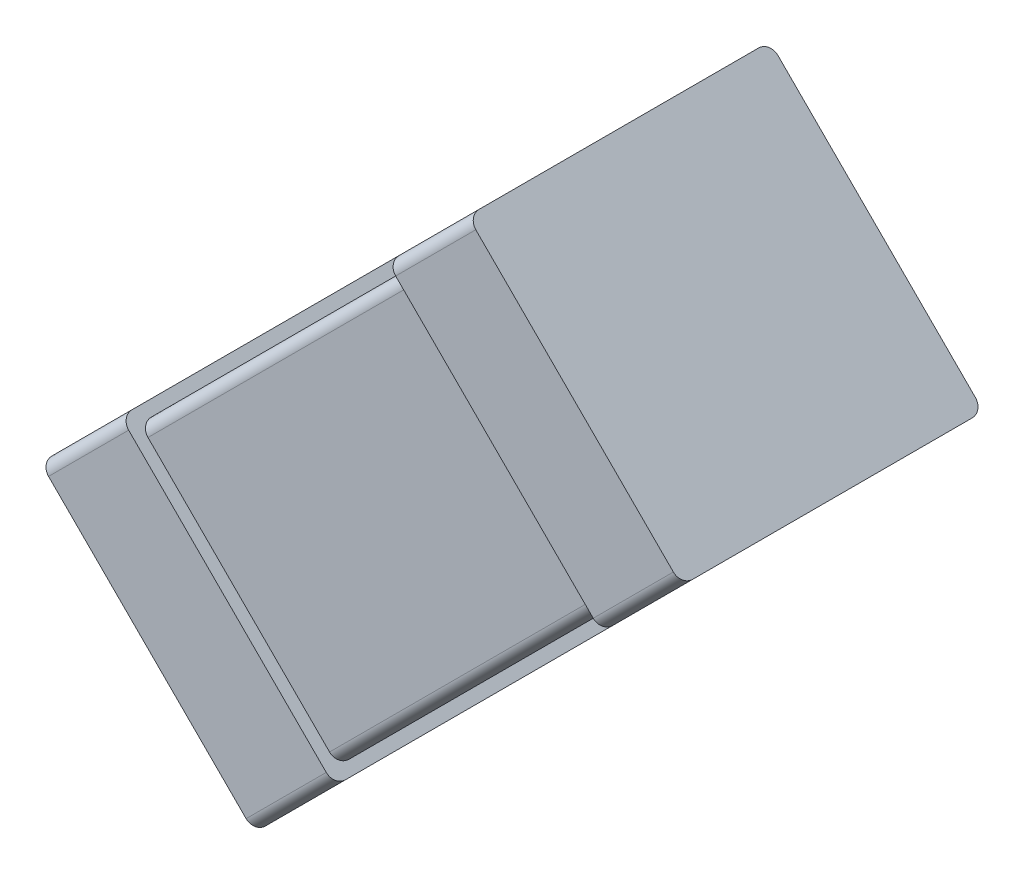
ISO-10303-21;
HEADER;
FILE_DESCRIPTION(('STEP AP214'),'2;1');
FILE_NAME('part.step','',(''),(''),'','','');
FILE_SCHEMA(('AUTOMOTIVE_DESIGN { 1 0 10303 214 1 1 1 1 }'));
ENDSEC;
DATA;
#1=APPLICATION_CONTEXT('core data for automotive mechanical design processes');
#2=APPLICATION_PROTOCOL_DEFINITION('international standard','automotive_design',2000,#1);
#3=PRODUCT_CONTEXT('',#1,'mechanical');
#4=PRODUCT('Part','Part','',(#3));
#5=PRODUCT_RELATED_PRODUCT_CATEGORY('part','',(#4));
#6=PRODUCT_DEFINITION_FORMATION('','',#4);
#7=PRODUCT_DEFINITION_CONTEXT('part definition',#1,'design');
#8=PRODUCT_DEFINITION('design','',#6,#7);
#9=PRODUCT_DEFINITION_SHAPE('','',#8);
#10=(LENGTH_UNIT() NAMED_UNIT(*) SI_UNIT(.MILLI.,.METRE.));
#11=(NAMED_UNIT(*) PLANE_ANGLE_UNIT() SI_UNIT($,.RADIAN.));
#12=(NAMED_UNIT(*) SI_UNIT($,.STERADIAN.) SOLID_ANGLE_UNIT());
#13=UNCERTAINTY_MEASURE_WITH_UNIT(LENGTH_MEASURE(1.E-05),#10,'distance_accuracy_value','');
#14=(GEOMETRIC_REPRESENTATION_CONTEXT(3) GLOBAL_UNCERTAINTY_ASSIGNED_CONTEXT((#13)) GLOBAL_UNIT_ASSIGNED_CONTEXT((#10,
#11,#12)) REPRESENTATION_CONTEXT('',''));
#15=CARTESIAN_POINT('',(0.,0.,0.));
#16=DIRECTION('',(0.,0.,1.));
#17=DIRECTION('',(1.,0.,0.));
#18=AXIS2_PLACEMENT_3D('',#15,#16,#17);
#19=CARTESIAN_POINT('',(168.761272417362,108.552886004825,112.211582908599));
#20=DIRECTION('',(0.707106781186547,0.707106781186548,0.));
#21=DIRECTION('',(0.,0.,-1.));
#22=AXIS2_PLACEMENT_3D('',#19,#20,#21);
#23=PLANE('',#22);
#24=DIRECTION('',(0.,0.,1.));
#25=VECTOR('',#24,1.);
#26=CARTESIAN_POINT('',(168.761272417362,108.552886004825,112.211582908599));
#27=LINE('',#26,#25);
#28=CARTESIAN_POINT('',(168.761272417362,108.552886004825,112.241582908599));
#29=VERTEX_POINT('',#28);
#30=CARTESIAN_POINT('',(168.761272417362,108.552886004825,112.981582908599));
#31=VERTEX_POINT('',#30);
#32=EDGE_CURVE('E67',#29,#31,#27,.T.);
#33=ORIENTED_EDGE('',*,*,#32,.F.);
#34=CARTESIAN_POINT('',(168.740059213926,108.57409920826,112.241582908599));
#35=DIRECTION('',(0.707106781186547,0.707106781186548,0.));
#36=DIRECTION('',(0.,0.,1.));
#37=AXIS2_PLACEMENT_3D('',#34,#35,#36);
#38=CIRCLE('',#37,0.0300000000000023);
#39=CARTESIAN_POINT('',(168.740059213926,108.57409920826,112.211582908599));
#40=VERTEX_POINT('',#39);
#41=EDGE_CURVE('E11',#29,#40,#38,.T.);
#42=ORIENTED_EDGE('',*,*,#41,.T.);
#43=DIRECTION('',(-0.707106781186548,0.707106781186547,0.));
#44=VECTOR('',#43,1.);
#45=CARTESIAN_POINT('',(168.761272417362,108.552886004825,112.211582908599));
#46=LINE('',#45,#44);
#47=CARTESIAN_POINT('',(168.216800195848,109.097358226338,112.211582908599));
#48=VERTEX_POINT('',#47);
#49=EDGE_CURVE('E55',#40,#48,#46,.T.);
#50=ORIENTED_EDGE('',*,*,#49,.T.);
#51=CARTESIAN_POINT('',(168.216800195848,109.097358226338,112.241582908599));
#52=DIRECTION('',(-0.707106781186547,-0.707106781186548,0.));
#53=DIRECTION('',(0.,0.,1.));
#54=AXIS2_PLACEMENT_3D('',#51,#52,#53);
#55=CIRCLE('',#54,0.0300000000000023);
#56=CARTESIAN_POINT('',(168.195586992413,109.118571429774,112.241582908599));
#57=VERTEX_POINT('',#56);
#58=EDGE_CURVE('E287',#57,#48,#55,.T.);
#59=ORIENTED_EDGE('',*,*,#58,.F.);
#60=DIRECTION('',(0.,0.,1.));
#61=VECTOR('',#60,1.);
#62=CARTESIAN_POINT('',(168.195586992413,109.118571429774,112.211582908599));
#63=LINE('',#62,#61);
#64=CARTESIAN_POINT('',(168.195586992413,109.118571429774,112.981582908599));
#65=VERTEX_POINT('',#64);
#66=EDGE_CURVE('E277',#57,#65,#63,.T.);
#67=ORIENTED_EDGE('',*,*,#66,.T.);
#68=CARTESIAN_POINT('',(168.216800195848,109.097358226338,112.981582908599));
#69=DIRECTION('',(0.707106781186547,0.707106781186548,0.));
#70=DIRECTION('',(0.,0.,1.));
#71=AXIS2_PLACEMENT_3D('',#68,#69,#70);
#72=CIRCLE('',#71,0.0300000000000023);
#73=CARTESIAN_POINT('',(168.216800195848,109.097358226338,113.011582908599));
#74=VERTEX_POINT('',#73);
#75=EDGE_CURVE('E281',#65,#74,#72,.T.);
#76=ORIENTED_EDGE('',*,*,#75,.T.);
#77=DIRECTION('',(-0.707106781186548,0.707106781186547,0.));
#78=VECTOR('',#77,1.);
#79=CARTESIAN_POINT('',(168.761272417362,108.552886004825,113.011582908599));
#80=LINE('',#79,#78);
#81=CARTESIAN_POINT('',(168.740059213926,108.57409920826,113.011582908599));
#82=VERTEX_POINT('',#81);
#83=EDGE_CURVE('E264',#82,#74,#80,.T.);
#84=ORIENTED_EDGE('',*,*,#83,.F.);
#85=CARTESIAN_POINT('',(168.740059213926,108.57409920826,112.981582908599));
#86=DIRECTION('',(-0.707106781186547,-0.707106781186548,0.));
#87=DIRECTION('',(0.,0.,1.));
#88=AXIS2_PLACEMENT_3D('',#85,#86,#87);
#89=CIRCLE('',#88,0.0300000000000023);
#90=EDGE_CURVE('E418',#31,#82,#89,.T.);
#91=ORIENTED_EDGE('',*,*,#90,.F.);
#92=EDGE_LOOP('',(#33,#42,#50,#59,#67,#76,#84,#91));
#93=FACE_BOUND('',#92,.T.);
#94=ADVANCED_FACE('F44',(#93),#23,.T.);
#95=CARTESIAN_POINT('',(167.983454958057,108.906439395418,112.211582908599));
#96=DIRECTION('',(-0.707106781186548,0.707106781186547,0.));
#97=DIRECTION('',(0.,0.,1.));
#98=AXIS2_PLACEMENT_3D('',#95,#96,#97);
#99=PLANE('',#98);
#100=ORIENTED_EDGE('',*,*,#66,.F.);
#101=DIRECTION('',(0.707106781186547,0.707106781186548,0.));
#102=VECTOR('',#101,1.);
#103=CARTESIAN_POINT('',(167.983454958057,108.906439395418,112.241582908599));
#104=LINE('',#103,#102);
#105=CARTESIAN_POINT('',(167.983454958057,108.906439395418,112.241582908599));
#106=VERTEX_POINT('',#105);
#107=EDGE_CURVE('E282',#106,#57,#104,.T.);
#108=ORIENTED_EDGE('',*,*,#107,.F.);
#109=DIRECTION('',(0.,0.,1.));
#110=VECTOR('',#109,1.);
#111=CARTESIAN_POINT('',(167.983454958057,108.906439395418,112.211582908599));
#112=LINE('',#111,#110);
#113=CARTESIAN_POINT('',(167.983454958057,108.906439395418,112.981582908599));
#114=VERTEX_POINT('',#113);
#115=EDGE_CURVE('E392',#106,#114,#112,.T.);
#116=ORIENTED_EDGE('',*,*,#115,.T.);
#117=DIRECTION('',(0.707106781186547,0.707106781186548,0.));
#118=VECTOR('',#117,1.);
#119=CARTESIAN_POINT('',(167.983454958057,108.906439395418,112.981582908599));
#120=LINE('',#119,#118);
#121=EDGE_CURVE('E384',#114,#65,#120,.T.);
#122=ORIENTED_EDGE('',*,*,#121,.T.);
#123=EDGE_LOOP('',(#100,#108,#116,#122));
#124=FACE_BOUND('',#123,.T.);
#125=ADVANCED_FACE('F591',(#124),#99,.T.);
#126=CARTESIAN_POINT('',(168.004668161492,108.885226191982,112.981582908599));
#127=DIRECTION('',(0.707106781186548,0.707106781186548,0.));
#128=DIRECTION('',(-0.707106781186548,0.707106781186548,0.));
#129=AXIS2_PLACEMENT_3D('',#126,#127,#128);
#130=CYLINDRICAL_SURFACE('',#129,0.0299999999999963);
#131=CARTESIAN_POINT('',(168.004668161492,108.885226191982,112.981582908599));
#132=DIRECTION('',(0.707106781186547,0.707106781186548,0.));
#133=DIRECTION('',(0.,0.,1.));
#134=AXIS2_PLACEMENT_3D('',#131,#132,#133);
#135=CIRCLE('',#134,0.0300000000000023);
#136=CARTESIAN_POINT('',(168.004668161492,108.885226191982,113.011582908599));
#137=VERTEX_POINT('',#136);
#138=EDGE_CURVE('E377',#114,#137,#135,.T.);
#139=ORIENTED_EDGE('',*,*,#138,.T.);
#140=DIRECTION('',(0.707106781186547,0.707106781186548,0.));
#141=VECTOR('',#140,1.);
#142=CARTESIAN_POINT('',(168.004668161492,108.885226191982,113.011582908599));
#143=LINE('',#142,#141);
#144=EDGE_CURVE('E286',#137,#74,#143,.T.);
#145=ORIENTED_EDGE('',*,*,#144,.T.);
#146=ORIENTED_EDGE('',*,*,#75,.F.);
#147=ORIENTED_EDGE('',*,*,#121,.F.);
#148=EDGE_LOOP('',(#139,#145,#146,#147));
#149=FACE_BOUND('',#148,.T.);
#150=ADVANCED_FACE('F596',(#149),#130,.T.);
#151=CARTESIAN_POINT('',(168.004668161492,108.885226191982,112.241582908599));
#152=DIRECTION('',(0.707106781186548,0.707106781186548,0.));
#153=DIRECTION('',(-0.707106781186548,0.707106781186548,0.));
#154=AXIS2_PLACEMENT_3D('',#151,#152,#153);
#155=CYLINDRICAL_SURFACE('',#154,0.0299999999999963);
#156=ORIENTED_EDGE('',*,*,#107,.T.);
#157=ORIENTED_EDGE('',*,*,#58,.T.);
#158=DIRECTION('',(0.707106781186547,0.707106781186548,0.));
#159=VECTOR('',#158,1.);
#160=CARTESIAN_POINT('',(168.004668161492,108.885226191982,112.211582908599));
#161=LINE('',#160,#159);
#162=CARTESIAN_POINT('',(168.004668161492,108.885226191982,112.211582908599));
#163=VERTEX_POINT('',#162);
#164=EDGE_CURVE('E396',#163,#48,#161,.T.);
#165=ORIENTED_EDGE('',*,*,#164,.F.);
#166=CARTESIAN_POINT('',(168.004668161492,108.885226191982,112.241582908599));
#167=DIRECTION('',(-0.707106781186547,-0.707106781186548,0.));
#168=DIRECTION('',(0.,0.,1.));
#169=AXIS2_PLACEMENT_3D('',#166,#167,#168);
#170=CIRCLE('',#169,0.0300000000000023);
#171=EDGE_CURVE('E305',#106,#163,#170,.T.);
#172=ORIENTED_EDGE('',*,*,#171,.F.);
#173=EDGE_LOOP('',(#156,#157,#165,#172));
#174=FACE_BOUND('',#173,.T.);
#175=ADVANCED_FACE('F648',(#174),#155,.T.);
#176=CARTESIAN_POINT('',(168.549140383006,108.340753970469,113.011582908599));
#177=DIRECTION('',(0.,0.,1.));
#178=DIRECTION('',(1.,0.,0.));
#179=AXIS2_PLACEMENT_3D('',#176,#177,#178);
#180=PLANE('',#179);
#181=DIRECTION('',(-0.707106781186548,0.707106781186547,0.));
#182=VECTOR('',#181,1.);
#183=CARTESIAN_POINT('',(168.549140383006,108.340753970469,113.011582908599));
#184=LINE('',#183,#182);
#185=CARTESIAN_POINT('',(168.52792717957,108.361967173904,113.011582908599));
#186=VERTEX_POINT('',#185);
#187=EDGE_CURVE('E308',#186,#137,#184,.T.);
#188=ORIENTED_EDGE('',*,*,#187,.F.);
#189=DIRECTION('',(0.707106781186547,0.707106781186548,0.));
#190=VECTOR('',#189,1.);
#191=CARTESIAN_POINT('',(168.52792717957,108.361967173904,113.011582908599));
#192=LINE('',#191,#190);
#193=EDGE_CURVE('E452',#186,#82,#192,.T.);
#194=ORIENTED_EDGE('',*,*,#193,.T.);
#195=ORIENTED_EDGE('',*,*,#83,.T.);
#196=ORIENTED_EDGE('',*,*,#144,.F.);
#197=EDGE_LOOP('',(#188,#194,#195,#196));
#198=FACE_BOUND('',#197,.T.);
#199=ADVANCED_FACE('F46',(#198),#180,.T.);
#200=CARTESIAN_POINT('',(168.549140383006,108.340753970469,112.211582908599));
#201=DIRECTION('',(0.,0.,1.));
#202=DIRECTION('',(1.,0.,0.));
#203=AXIS2_PLACEMENT_3D('',#200,#201,#202);
#204=PLANE('',#203);
#205=ORIENTED_EDGE('',*,*,#164,.T.);
#206=ORIENTED_EDGE('',*,*,#49,.F.);
#207=DIRECTION('',(0.707106781186547,0.707106781186548,0.));
#208=VECTOR('',#207,1.);
#209=CARTESIAN_POINT('',(168.52792717957,108.361967173904,112.211582908599));
#210=LINE('',#209,#208);
#211=CARTESIAN_POINT('',(168.52792717957,108.361967173904,112.211582908599));
#212=VERTEX_POINT('',#211);
#213=EDGE_CURVE('E329',#212,#40,#210,.T.);
#214=ORIENTED_EDGE('',*,*,#213,.F.);
#215=DIRECTION('',(-0.707106781186548,0.707106781186547,0.));
#216=VECTOR('',#215,1.);
#217=CARTESIAN_POINT('',(168.549140383006,108.340753970469,112.211582908599));
#218=LINE('',#217,#216);
#219=EDGE_CURVE('E399',#212,#163,#218,.T.);
#220=ORIENTED_EDGE('',*,*,#219,.T.);
#221=EDGE_LOOP('',(#205,#206,#214,#220));
#222=FACE_BOUND('',#221,.T.);
#223=ADVANCED_FACE('F647',(#222),#204,.F.);
#224=CARTESIAN_POINT('',(168.52792717957,108.361967173904,112.981582908599));
#225=DIRECTION('',(0.707106781186548,0.707106781186548,0.));
#226=DIRECTION('',(0.707106781186548,-0.707106781186548,0.));
#227=AXIS2_PLACEMENT_3D('',#224,#225,#226);
#228=CYLINDRICAL_SURFACE('',#227,0.0299999999999963);
#229=DIRECTION('',(0.707106781186547,0.707106781186548,0.));
#230=VECTOR('',#229,1.);
#231=CARTESIAN_POINT('',(168.549140383006,108.340753970469,112.981582908599));
#232=LINE('',#231,#230);
#233=CARTESIAN_POINT('',(168.549140383006,108.340753970469,112.981582908599));
#234=VERTEX_POINT('',#233);
#235=EDGE_CURVE('E406',#234,#31,#232,.T.);
#236=ORIENTED_EDGE('',*,*,#235,.T.);
#237=ORIENTED_EDGE('',*,*,#90,.T.);
#238=ORIENTED_EDGE('',*,*,#193,.F.);
#239=CARTESIAN_POINT('',(168.52792717957,108.361967173904,112.981582908599));
#240=DIRECTION('',(-0.707106781186547,-0.707106781186548,0.));
#241=DIRECTION('',(0.,0.,1.));
#242=AXIS2_PLACEMENT_3D('',#239,#240,#241);
#243=CIRCLE('',#242,0.0300000000000023);
#244=EDGE_CURVE('E355',#234,#186,#243,.T.);
#245=ORIENTED_EDGE('',*,*,#244,.F.);
#246=EDGE_LOOP('',(#236,#237,#238,#245));
#247=FACE_BOUND('',#246,.T.);
#248=ADVANCED_FACE('F550',(#247),#228,.T.);
#249=CARTESIAN_POINT('',(168.52792717957,108.361967173904,112.241582908599));
#250=DIRECTION('',(0.707106781186548,0.707106781186548,0.));
#251=DIRECTION('',(0.707106781186548,-0.707106781186548,0.));
#252=AXIS2_PLACEMENT_3D('',#249,#250,#251);
#253=CYLINDRICAL_SURFACE('',#252,0.0299999999999963);
#254=CARTESIAN_POINT('',(168.52792717957,108.361967173904,112.241582908599));
#255=DIRECTION('',(0.707106781186547,0.707106781186548,0.));
#256=DIRECTION('',(0.,0.,1.));
#257=AXIS2_PLACEMENT_3D('',#254,#255,#256);
#258=CIRCLE('',#257,0.0300000000000023);
#259=CARTESIAN_POINT('',(168.549140383006,108.340753970469,112.241582908599));
#260=VERTEX_POINT('',#259);
#261=EDGE_CURVE('E333',#260,#212,#258,.T.);
#262=ORIENTED_EDGE('',*,*,#261,.T.);
#263=ORIENTED_EDGE('',*,*,#213,.T.);
#264=ORIENTED_EDGE('',*,*,#41,.F.);
#265=DIRECTION('',(0.707106781186547,0.707106781186548,0.));
#266=VECTOR('',#265,1.);
#267=CARTESIAN_POINT('',(168.549140383006,108.340753970469,112.241582908599));
#268=LINE('',#267,#266);
#269=EDGE_CURVE('E48',#260,#29,#268,.T.);
#270=ORIENTED_EDGE('',*,*,#269,.F.);
#271=EDGE_LOOP('',(#262,#263,#264,#270));
#272=FACE_BOUND('',#271,.T.);
#273=ADVANCED_FACE('F611',(#272),#253,.T.);
#274=CARTESIAN_POINT('',(168.549140383006,108.340753970469,112.211582908599));
#275=DIRECTION('',(-0.707106781186548,0.707106781186547,0.));
#276=DIRECTION('',(0.,0.,1.));
#277=AXIS2_PLACEMENT_3D('',#274,#275,#276);
#278=PLANE('',#277);
#279=ORIENTED_EDGE('',*,*,#235,.F.);
#280=DIRECTION('',(0.,0.,1.));
#281=VECTOR('',#280,1.);
#282=CARTESIAN_POINT('',(168.549140383006,108.340753970469,112.211582908599));
#283=LINE('',#282,#281);
#284=EDGE_CURVE('E309',#260,#234,#283,.T.);
#285=ORIENTED_EDGE('',*,*,#284,.F.);
#286=ORIENTED_EDGE('',*,*,#269,.T.);
#287=ORIENTED_EDGE('',*,*,#32,.T.);
#288=EDGE_LOOP('',(#279,#285,#286,#287));
#289=FACE_BOUND('',#288,.T.);
#290=ADVANCED_FACE('F560',(#289),#278,.F.);
#291=CARTESIAN_POINT('',(168.549140383006,108.340753970469,112.211582908599));
#292=DIRECTION('',(0.707106781186547,0.707106781186548,0.));
#293=DIRECTION('',(0.,0.,-1.));
#294=AXIS2_PLACEMENT_3D('',#291,#292,#293);
#295=PLANE('',#294);
#296=ORIENTED_EDGE('',*,*,#244,.T.);
#297=ORIENTED_EDGE('',*,*,#187,.T.);
#298=ORIENTED_EDGE('',*,*,#138,.F.);
#299=ORIENTED_EDGE('',*,*,#115,.F.);
#300=ORIENTED_EDGE('',*,*,#171,.T.);
#301=ORIENTED_EDGE('',*,*,#219,.F.);
#302=ORIENTED_EDGE('',*,*,#261,.F.);
#303=ORIENTED_EDGE('',*,*,#284,.T.);
#304=EDGE_LOOP('',(#296,#297,#298,#299,#300,#301,#302,#303));
#305=FACE_BOUND('',#304,.T.);
#306=DIRECTION('',(-0.707106781186548,0.707106781186547,0.));
#307=VECTOR('',#306,1.);
#308=CARTESIAN_POINT('',(168.52792717957,108.361967173904,112.241582908599));
#309=LINE('',#308,#307);
#310=CARTESIAN_POINT('',(168.506713976134,108.38318037734,112.241582908599));
#311=VERTEX_POINT('',#310);
#312=CARTESIAN_POINT('',(168.025881364928,108.864012988547,112.241582908599));
#313=VERTEX_POINT('',#312);
#314=EDGE_CURVE('E341',#311,#313,#309,.T.);
#315=ORIENTED_EDGE('',*,*,#314,.T.);
#316=CARTESIAN_POINT('',(168.025881364928,108.864012988547,112.271582908599));
#317=DIRECTION('',(-0.707106781186547,-0.707106781186548,0.));
#318=DIRECTION('',(0.,0.,1.));
#319=AXIS2_PLACEMENT_3D('',#316,#317,#318);
#320=CIRCLE('',#319,0.0300000000000023);
#321=CARTESIAN_POINT('',(168.004668161492,108.885226191982,112.271582908599));
#322=VERTEX_POINT('',#321);
#323=EDGE_CURVE('E360',#322,#313,#320,.T.);
#324=ORIENTED_EDGE('',*,*,#323,.F.);
#325=DIRECTION('',(0.,0.,1.));
#326=VECTOR('',#325,1.);
#327=CARTESIAN_POINT('',(168.004668161492,108.885226191982,112.241582908599));
#328=LINE('',#327,#326);
#329=CARTESIAN_POINT('',(168.004668161492,108.885226191982,112.951582908599));
#330=VERTEX_POINT('',#329);
#331=EDGE_CURVE('E453',#322,#330,#328,.T.);
#332=ORIENTED_EDGE('',*,*,#331,.T.);
#333=CARTESIAN_POINT('',(168.025881364928,108.864012988547,112.951582908599));
#334=DIRECTION('',(0.707106781186547,0.707106781186548,0.));
#335=DIRECTION('',(0.,0.,1.));
#336=AXIS2_PLACEMENT_3D('',#333,#334,#335);
#337=CIRCLE('',#336,0.0300000000000023);
#338=CARTESIAN_POINT('',(168.025881364928,108.864012988547,112.981582908599));
#339=VERTEX_POINT('',#338);
#340=EDGE_CURVE('E233',#330,#339,#337,.T.);
#341=ORIENTED_EDGE('',*,*,#340,.T.);
#342=DIRECTION('',(-0.707106781186548,0.707106781186547,0.));
#343=VECTOR('',#342,1.);
#344=CARTESIAN_POINT('',(168.52792717957,108.361967173904,112.981582908599));
#345=LINE('',#344,#343);
#346=CARTESIAN_POINT('',(168.506713976134,108.38318037734,112.981582908599));
#347=VERTEX_POINT('',#346);
#348=EDGE_CURVE('E250',#347,#339,#345,.T.);
#349=ORIENTED_EDGE('',*,*,#348,.F.);
#350=CARTESIAN_POINT('',(168.506713976134,108.38318037734,112.951582908599));
#351=DIRECTION('',(-0.707106781186547,-0.707106781186548,0.));
#352=DIRECTION('',(0.,0.,1.));
#353=AXIS2_PLACEMENT_3D('',#350,#351,#352);
#354=CIRCLE('',#353,0.0300000000000023);
#355=CARTESIAN_POINT('',(168.52792717957,108.361967173904,112.951582908599));
#356=VERTEX_POINT('',#355);
#357=EDGE_CURVE('E276',#356,#347,#354,.T.);
#358=ORIENTED_EDGE('',*,*,#357,.F.);
#359=DIRECTION('',(0.,0.,1.));
#360=VECTOR('',#359,1.);
#361=CARTESIAN_POINT('',(168.52792717957,108.361967173904,112.241582908599));
#362=LINE('',#361,#360);
#363=CARTESIAN_POINT('',(168.52792717957,108.361967173904,112.271582908599));
#364=VERTEX_POINT('',#363);
#365=EDGE_CURVE('E275',#364,#356,#362,.T.);
#366=ORIENTED_EDGE('',*,*,#365,.F.);
#367=CARTESIAN_POINT('',(168.506713976134,108.38318037734,112.271582908599));
#368=DIRECTION('',(0.707106781186547,0.707106781186548,0.));
#369=DIRECTION('',(0.,0.,1.));
#370=AXIS2_PLACEMENT_3D('',#367,#368,#369);
#371=CIRCLE('',#370,0.0300000000000023);
#372=EDGE_CURVE('E337',#364,#311,#371,.T.);
#373=ORIENTED_EDGE('',*,*,#372,.T.);
#374=EDGE_LOOP('',(#315,#324,#332,#341,#349,#358,#366,#373));
#375=FACE_BOUND('',#374,.T.);
#376=ADVANCED_FACE('F553',(#305,#375),#295,.F.);
#377=CARTESIAN_POINT('',(167.820820398384,107.654860392718,112.241582908599));
#378=DIRECTION('',(-0.707106781186548,0.707106781186547,0.));
#379=DIRECTION('',(0.,0.,1.));
#380=AXIS2_PLACEMENT_3D('',#377,#378,#379);
#381=PLANE('',#380);
#382=DIRECTION('',(0.707106781186547,0.707106781186548,0.));
#383=VECTOR('',#382,1.);
#384=CARTESIAN_POINT('',(167.820820398384,107.654860392718,112.951582908599));
#385=LINE('',#384,#383);
#386=CARTESIAN_POINT('',(167.820820398384,107.654860392718,112.951582908599));
#387=VERTEX_POINT('',#386);
#388=EDGE_CURVE('E271',#387,#356,#385,.T.);
#389=ORIENTED_EDGE('',*,*,#388,.F.);
#390=DIRECTION('',(0.,0.,1.));
#391=VECTOR('',#390,1.);
#392=CARTESIAN_POINT('',(167.820820398384,107.654860392718,112.241582908599));
#393=LINE('',#392,#391);
#394=CARTESIAN_POINT('',(167.820820398384,107.654860392718,112.271582908599));
#395=VERTEX_POINT('',#394);
#396=EDGE_CURVE('E123',#395,#387,#393,.T.);
#397=ORIENTED_EDGE('',*,*,#396,.F.);
#398=DIRECTION('',(0.707106781186547,0.707106781186548,0.));
#399=VECTOR('',#398,1.);
#400=CARTESIAN_POINT('',(167.820820398384,107.654860392718,112.271582908599));
#401=LINE('',#400,#399);
#402=EDGE_CURVE('E334',#395,#364,#401,.T.);
#403=ORIENTED_EDGE('',*,*,#402,.T.);
#404=ORIENTED_EDGE('',*,*,#365,.T.);
#405=EDGE_LOOP('',(#389,#397,#403,#404));
#406=FACE_BOUND('',#405,.T.);
#407=ADVANCED_FACE('F577',(#406),#381,.F.);
#408=CARTESIAN_POINT('',(167.799607194948,107.676073596153,112.951582908599));
#409=DIRECTION('',(0.707106781186548,0.707106781186548,0.));
#410=DIRECTION('',(0.707106781186548,-0.707106781186548,0.));
#411=AXIS2_PLACEMENT_3D('',#408,#409,#410);
#412=CYLINDRICAL_SURFACE('',#411,0.0299999999999963);
#413=ORIENTED_EDGE('',*,*,#388,.T.);
#414=ORIENTED_EDGE('',*,*,#357,.T.);
#415=DIRECTION('',(0.707106781186547,0.707106781186548,0.));
#416=VECTOR('',#415,1.);
#417=CARTESIAN_POINT('',(167.799607194948,107.676073596153,112.981582908599));
#418=LINE('',#417,#416);
#419=CARTESIAN_POINT('',(167.799607194948,107.676073596153,112.981582908599));
#420=VERTEX_POINT('',#419);
#421=EDGE_CURVE('E291',#420,#347,#418,.T.);
#422=ORIENTED_EDGE('',*,*,#421,.F.);
#423=CARTESIAN_POINT('',(167.799607194948,107.676073596153,112.951582908599));
#424=DIRECTION('',(-0.707106781186547,-0.707106781186548,0.));
#425=DIRECTION('',(0.,0.,1.));
#426=AXIS2_PLACEMENT_3D('',#423,#424,#425);
#427=CIRCLE('',#426,0.0300000000000023);
#428=EDGE_CURVE('E138',#387,#420,#427,.T.);
#429=ORIENTED_EDGE('',*,*,#428,.F.);
#430=EDGE_LOOP('',(#413,#414,#422,#429));
#431=FACE_BOUND('',#430,.T.);
#432=ADVANCED_FACE('F579',(#431),#412,.T.);
#433=CARTESIAN_POINT('',(167.820820398384,107.654860392718,112.981582908599));
#434=DIRECTION('',(0.,0.,1.));
#435=DIRECTION('',(1.,0.,0.));
#436=AXIS2_PLACEMENT_3D('',#433,#434,#435);
#437=PLANE('',#436);
#438=DIRECTION('',(-0.707106781186548,0.707106781186547,0.));
#439=VECTOR('',#438,1.);
#440=CARTESIAN_POINT('',(167.820820398384,107.654860392718,112.981582908599));
#441=LINE('',#440,#439);
#442=CARTESIAN_POINT('',(167.318774583742,108.15690620736,112.981582908599));
#443=VERTEX_POINT('',#442);
#444=EDGE_CURVE('E247',#420,#443,#441,.T.);
#445=ORIENTED_EDGE('',*,*,#444,.F.);
#446=ORIENTED_EDGE('',*,*,#421,.T.);
#447=ORIENTED_EDGE('',*,*,#348,.T.);
#448=DIRECTION('',(0.707106781186547,0.707106781186548,0.));
#449=VECTOR('',#448,1.);
#450=CARTESIAN_POINT('',(167.318774583742,108.15690620736,112.981582908599));
#451=LINE('',#450,#449);
#452=EDGE_CURVE('E251',#443,#339,#451,.T.);
#453=ORIENTED_EDGE('',*,*,#452,.F.);
#454=EDGE_LOOP('',(#445,#446,#447,#453));
#455=FACE_BOUND('',#454,.T.);
#456=ADVANCED_FACE('F585',(#455),#437,.T.);
#457=CARTESIAN_POINT('',(167.318774583742,108.15690620736,112.951582908599));
#458=DIRECTION('',(0.707106781186548,0.707106781186548,0.));
#459=DIRECTION('',(-0.707106781186548,0.707106781186548,0.));
#460=AXIS2_PLACEMENT_3D('',#457,#458,#459);
#461=CYLINDRICAL_SURFACE('',#460,0.0299999999999963);
#462=CARTESIAN_POINT('',(167.318774583742,108.15690620736,112.951582908599));
#463=DIRECTION('',(0.707106781186547,0.707106781186548,0.));
#464=DIRECTION('',(0.,0.,1.));
#465=AXIS2_PLACEMENT_3D('',#462,#463,#464);
#466=CIRCLE('',#465,0.0300000000000023);
#467=CARTESIAN_POINT('',(167.297561380306,108.178119410796,112.951582908599));
#468=VERTEX_POINT('',#467);
#469=EDGE_CURVE('E230',#468,#443,#466,.T.);
#470=ORIENTED_EDGE('',*,*,#469,.T.);
#471=ORIENTED_EDGE('',*,*,#452,.T.);
#472=ORIENTED_EDGE('',*,*,#340,.F.);
#473=DIRECTION('',(0.707106781186547,0.707106781186548,0.));
#474=VECTOR('',#473,1.);
#475=CARTESIAN_POINT('',(167.297561380306,108.178119410796,112.951582908599));
#476=LINE('',#475,#474);
#477=EDGE_CURVE('E226',#468,#330,#476,.T.);
#478=ORIENTED_EDGE('',*,*,#477,.F.);
#479=EDGE_LOOP('',(#470,#471,#472,#478));
#480=FACE_BOUND('',#479,.T.);
#481=ADVANCED_FACE('F228',(#480),#461,.T.);
#482=CARTESIAN_POINT('',(167.297561380306,108.178119410796,112.241582908599));
#483=DIRECTION('',(-0.707106781186548,0.707106781186547,0.));
#484=DIRECTION('',(0.,0.,1.));
#485=AXIS2_PLACEMENT_3D('',#482,#483,#484);
#486=PLANE('',#485);
#487=ORIENTED_EDGE('',*,*,#331,.F.);
#488=DIRECTION('',(0.707106781186547,0.707106781186548,0.));
#489=VECTOR('',#488,1.);
#490=CARTESIAN_POINT('',(167.297561380306,108.178119410796,112.271582908599));
#491=LINE('',#490,#489);
#492=CARTESIAN_POINT('',(167.297561380306,108.178119410796,112.271582908599));
#493=VERTEX_POINT('',#492);
#494=EDGE_CURVE('E240',#493,#322,#491,.T.);
#495=ORIENTED_EDGE('',*,*,#494,.F.);
#496=DIRECTION('',(0.,0.,1.));
#497=VECTOR('',#496,1.);
#498=CARTESIAN_POINT('',(167.297561380306,108.178119410796,112.241582908599));
#499=LINE('',#498,#497);
#500=EDGE_CURVE('E239',#493,#468,#499,.T.);
#501=ORIENTED_EDGE('',*,*,#500,.T.);
#502=ORIENTED_EDGE('',*,*,#477,.T.);
#503=EDGE_LOOP('',(#487,#495,#501,#502));
#504=FACE_BOUND('',#503,.T.);
#505=ADVANCED_FACE('F253',(#504),#486,.T.);
#506=CARTESIAN_POINT('',(167.318774583742,108.15690620736,112.271582908599));
#507=DIRECTION('',(0.707106781186548,0.707106781186548,0.));
#508=DIRECTION('',(-0.707106781186548,0.707106781186548,0.));
#509=AXIS2_PLACEMENT_3D('',#506,#507,#508);
#510=CYLINDRICAL_SURFACE('',#509,0.0299999999999963);
#511=ORIENTED_EDGE('',*,*,#494,.T.);
#512=ORIENTED_EDGE('',*,*,#323,.T.);
#513=DIRECTION('',(0.707106781186547,0.707106781186548,0.));
#514=VECTOR('',#513,1.);
#515=CARTESIAN_POINT('',(167.318774583742,108.15690620736,112.241582908599));
#516=LINE('',#515,#514);
#517=CARTESIAN_POINT('',(167.318774583742,108.15690620736,112.241582908599));
#518=VERTEX_POINT('',#517);
#519=EDGE_CURVE('E356',#518,#313,#516,.T.);
#520=ORIENTED_EDGE('',*,*,#519,.F.);
#521=CARTESIAN_POINT('',(167.318774583742,108.15690620736,112.271582908599));
#522=DIRECTION('',(-0.707106781186547,-0.707106781186548,0.));
#523=DIRECTION('',(0.,0.,1.));
#524=AXIS2_PLACEMENT_3D('',#521,#522,#523);
#525=CIRCLE('',#524,0.0300000000000023);
#526=EDGE_CURVE('E304',#493,#518,#525,.T.);
#527=ORIENTED_EDGE('',*,*,#526,.F.);
#528=EDGE_LOOP('',(#511,#512,#520,#527));
#529=FACE_BOUND('',#528,.T.);
#530=ADVANCED_FACE('F620',(#529),#510,.T.);
#531=CARTESIAN_POINT('',(167.820820398384,107.654860392718,112.241582908599));
#532=DIRECTION('',(0.,0.,1.));
#533=DIRECTION('',(1.,0.,0.));
#534=AXIS2_PLACEMENT_3D('',#531,#532,#533);
#535=PLANE('',#534);
#536=ORIENTED_EDGE('',*,*,#519,.T.);
#537=ORIENTED_EDGE('',*,*,#314,.F.);
#538=DIRECTION('',(0.707106781186547,0.707106781186548,0.));
#539=VECTOR('',#538,1.);
#540=CARTESIAN_POINT('',(167.799607194948,107.676073596153,112.241582908599));
#541=LINE('',#540,#539);
#542=CARTESIAN_POINT('',(167.799607194948,107.676073596153,112.241582908599));
#543=VERTEX_POINT('',#542);
#544=EDGE_CURVE('E314',#543,#311,#541,.T.);
#545=ORIENTED_EDGE('',*,*,#544,.F.);
#546=DIRECTION('',(-0.707106781186548,0.707106781186547,0.));
#547=VECTOR('',#546,1.);
#548=CARTESIAN_POINT('',(167.820820398384,107.654860392718,112.241582908599));
#549=LINE('',#548,#547);
#550=EDGE_CURVE('E361',#543,#518,#549,.T.);
#551=ORIENTED_EDGE('',*,*,#550,.T.);
#552=EDGE_LOOP('',(#536,#537,#545,#551));
#553=FACE_BOUND('',#552,.T.);
#554=ADVANCED_FACE('F622',(#553),#535,.F.);
#555=CARTESIAN_POINT('',(167.799607194948,107.676073596153,112.271582908599));
#556=DIRECTION('',(0.707106781186548,0.707106781186548,0.));
#557=DIRECTION('',(0.707106781186548,-0.707106781186548,0.));
#558=AXIS2_PLACEMENT_3D('',#555,#556,#557);
#559=CYLINDRICAL_SURFACE('',#558,0.0299999999999963);
#560=CARTESIAN_POINT('',(167.799607194948,107.676073596153,112.271582908599));
#561=DIRECTION('',(0.707106781186547,0.707106781186548,0.));
#562=DIRECTION('',(0.,0.,1.));
#563=AXIS2_PLACEMENT_3D('',#560,#561,#562);
#564=CIRCLE('',#563,0.0300000000000023);
#565=EDGE_CURVE('E411',#395,#543,#564,.T.);
#566=ORIENTED_EDGE('',*,*,#565,.T.);
#567=ORIENTED_EDGE('',*,*,#544,.T.);
#568=ORIENTED_EDGE('',*,*,#372,.F.);
#569=ORIENTED_EDGE('',*,*,#402,.F.);
#570=EDGE_LOOP('',(#566,#567,#568,#569));
#571=FACE_BOUND('',#570,.T.);
#572=ADVANCED_FACE('F576',(#571),#559,.T.);
#573=CARTESIAN_POINT('',(167.842033601819,107.633647189282,112.211582908599));
#574=DIRECTION('',(0.707106781186547,0.707106781186548,0.));
#575=DIRECTION('',(0.,0.,-1.));
#576=AXIS2_PLACEMENT_3D('',#573,#574,#575);
#577=PLANE('',#576);
#578=DIRECTION('',(0.,0.,1.));
#579=VECTOR('',#578,1.);
#580=CARTESIAN_POINT('',(167.842033601819,107.633647189282,112.211582908599));
#581=LINE('',#580,#579);
#582=CARTESIAN_POINT('',(167.842033601819,107.633647189282,112.241582908599));
#583=VERTEX_POINT('',#582);
#584=CARTESIAN_POINT('',(167.842033601819,107.633647189282,112.981582908599));
#585=VERTEX_POINT('',#584);
#586=EDGE_CURVE('E292',#583,#585,#581,.T.);
#587=ORIENTED_EDGE('',*,*,#586,.F.);
#588=CARTESIAN_POINT('',(167.820820398384,107.654860392718,112.241582908599));
#589=DIRECTION('',(0.707106781186547,0.707106781186548,0.));
#590=DIRECTION('',(0.,0.,1.));
#591=AXIS2_PLACEMENT_3D('',#588,#589,#590);
#592=CIRCLE('',#591,0.0300000000000023);
#593=CARTESIAN_POINT('',(167.820820398384,107.654860392718,112.211582908599));
#594=VERTEX_POINT('',#593);
#595=EDGE_CURVE('E310',#583,#594,#592,.T.);
#596=ORIENTED_EDGE('',*,*,#595,.T.);
#597=DIRECTION('',(-0.707106781186548,0.707106781186547,0.));
#598=VECTOR('',#597,1.);
#599=CARTESIAN_POINT('',(167.842033601819,107.633647189282,112.211582908599));
#600=LINE('',#599,#598);
#601=CARTESIAN_POINT('',(167.297561380306,108.178119410796,112.211582908599));
#602=VERTEX_POINT('',#601);
#603=EDGE_CURVE('E315',#594,#602,#600,.T.);
#604=ORIENTED_EDGE('',*,*,#603,.T.);
#605=CARTESIAN_POINT('',(167.297561380306,108.178119410796,112.241582908599));
#606=DIRECTION('',(-0.707106781186547,-0.707106781186548,0.));
#607=DIRECTION('',(0.,0.,1.));
#608=AXIS2_PLACEMENT_3D('',#605,#606,#607);
#609=CIRCLE('',#608,0.0300000000000023);
#610=CARTESIAN_POINT('',(167.27634817687,108.199332614231,112.241582908599));
#611=VERTEX_POINT('',#610);
#612=EDGE_CURVE('E269',#611,#602,#609,.T.);
#613=ORIENTED_EDGE('',*,*,#612,.F.);
#614=DIRECTION('',(0.,0.,1.));
#615=VECTOR('',#614,1.);
#616=CARTESIAN_POINT('',(167.27634817687,108.199332614231,112.211582908599));
#617=LINE('',#616,#615);
#618=CARTESIAN_POINT('',(167.27634817687,108.199332614231,112.981582908599));
#619=VERTEX_POINT('',#618);
#620=EDGE_CURVE('E325',#611,#619,#617,.T.);
#621=ORIENTED_EDGE('',*,*,#620,.T.);
#622=CARTESIAN_POINT('',(167.297561380306,108.178119410796,112.981582908599));
#623=DIRECTION('',(0.707106781186547,0.707106781186548,0.));
#624=DIRECTION('',(0.,0.,1.));
#625=AXIS2_PLACEMENT_3D('',#622,#623,#624);
#626=CIRCLE('',#625,0.0300000000000023);
#627=CARTESIAN_POINT('',(167.297561380306,108.178119410796,113.011582908599));
#628=VERTEX_POINT('',#627);
#629=EDGE_CURVE('E321',#619,#628,#626,.T.);
#630=ORIENTED_EDGE('',*,*,#629,.T.);
#631=DIRECTION('',(-0.707106781186548,0.707106781186547,0.));
#632=VECTOR('',#631,1.);
#633=CARTESIAN_POINT('',(167.842033601819,107.633647189282,113.011582908599));
#634=LINE('',#633,#632);
#635=CARTESIAN_POINT('',(167.820820398384,107.654860392718,113.011582908599));
#636=VERTEX_POINT('',#635);
#637=EDGE_CURVE('E270',#636,#628,#634,.T.);
#638=ORIENTED_EDGE('',*,*,#637,.F.);
#639=CARTESIAN_POINT('',(167.820820398384,107.654860392718,112.981582908599));
#640=DIRECTION('',(-0.707106781186547,-0.707106781186548,0.));
#641=DIRECTION('',(0.,0.,1.));
#642=AXIS2_PLACEMENT_3D('',#639,#640,#641);
#643=CIRCLE('',#642,0.0300000000000023);
#644=EDGE_CURVE('E371',#585,#636,#643,.T.);
#645=ORIENTED_EDGE('',*,*,#644,.F.);
#646=EDGE_LOOP('',(#587,#596,#604,#613,#621,#630,#638,#645));
#647=FACE_BOUND('',#646,.T.);
#648=ORIENTED_EDGE('',*,*,#565,.F.);
#649=ORIENTED_EDGE('',*,*,#396,.T.);
#650=ORIENTED_EDGE('',*,*,#428,.T.);
#651=ORIENTED_EDGE('',*,*,#444,.T.);
#652=ORIENTED_EDGE('',*,*,#469,.F.);
#653=ORIENTED_EDGE('',*,*,#500,.F.);
#654=ORIENTED_EDGE('',*,*,#526,.T.);
#655=ORIENTED_EDGE('',*,*,#550,.F.);
#656=EDGE_LOOP('',(#648,#649,#650,#651,#652,#653,#654,#655));
#657=FACE_BOUND('',#656,.T.);
#658=ADVANCED_FACE('F244',(#647,#657),#577,.T.);
#659=CARTESIAN_POINT('',(167.064216142514,107.987200579876,112.211582908599));
#660=DIRECTION('',(-0.707106781186548,0.707106781186547,0.));
#661=DIRECTION('',(0.,0.,1.));
#662=AXIS2_PLACEMENT_3D('',#659,#660,#661);
#663=PLANE('',#662);
#664=ORIENTED_EDGE('',*,*,#620,.F.);
#665=DIRECTION('',(0.707106781186547,0.707106781186548,0.));
#666=VECTOR('',#665,1.);
#667=CARTESIAN_POINT('',(167.064216142514,107.987200579876,112.241582908599));
#668=LINE('',#667,#666);
#669=CARTESIAN_POINT('',(167.064216142514,107.987200579876,112.241582908599));
#670=VERTEX_POINT('',#669);
#671=EDGE_CURVE('E362',#670,#611,#668,.T.);
#672=ORIENTED_EDGE('',*,*,#671,.F.);
#673=DIRECTION('',(0.,0.,1.));
#674=VECTOR('',#673,1.);
#675=CARTESIAN_POINT('',(167.064216142514,107.987200579876,112.211582908599));
#676=LINE('',#675,#674);
#677=CARTESIAN_POINT('',(167.064216142514,107.987200579876,112.981582908599));
#678=VERTEX_POINT('',#677);
#679=EDGE_CURVE('E421',#670,#678,#676,.T.);
#680=ORIENTED_EDGE('',*,*,#679,.T.);
#681=DIRECTION('',(0.707106781186547,0.707106781186548,0.));
#682=VECTOR('',#681,1.);
#683=CARTESIAN_POINT('',(167.064216142514,107.987200579876,112.981582908599));
#684=LINE('',#683,#682);
#685=EDGE_CURVE('E443',#678,#619,#684,.T.);
#686=ORIENTED_EDGE('',*,*,#685,.T.);
#687=EDGE_LOOP('',(#664,#672,#680,#686));
#688=FACE_BOUND('',#687,.T.);
#689=ADVANCED_FACE('F602',(#688),#663,.T.);
#690=CARTESIAN_POINT('',(167.08542934595,107.96598737644,112.981582908599));
#691=DIRECTION('',(0.707106781186548,0.707106781186548,0.));
#692=DIRECTION('',(-0.707106781186548,0.707106781186548,0.));
#693=AXIS2_PLACEMENT_3D('',#690,#691,#692);
#694=CYLINDRICAL_SURFACE('',#693,0.0299999999999963);
#695=CARTESIAN_POINT('',(167.08542934595,107.96598737644,112.981582908599));
#696=DIRECTION('',(0.707106781186547,0.707106781186548,0.));
#697=DIRECTION('',(0.,0.,1.));
#698=AXIS2_PLACEMENT_3D('',#695,#696,#697);
#699=CIRCLE('',#698,0.0300000000000023);
#700=CARTESIAN_POINT('',(167.08542934595,107.96598737644,113.011582908599));
#701=VERTEX_POINT('',#700);
#702=EDGE_CURVE('E410',#678,#701,#699,.T.);
#703=ORIENTED_EDGE('',*,*,#702,.T.);
#704=DIRECTION('',(0.707106781186547,0.707106781186548,0.));
#705=VECTOR('',#704,1.);
#706=CARTESIAN_POINT('',(167.08542934595,107.96598737644,113.011582908599));
#707=LINE('',#706,#705);
#708=EDGE_CURVE('E366',#701,#628,#707,.T.);
#709=ORIENTED_EDGE('',*,*,#708,.T.);
#710=ORIENTED_EDGE('',*,*,#629,.F.);
#711=ORIENTED_EDGE('',*,*,#685,.F.);
#712=EDGE_LOOP('',(#703,#709,#710,#711));
#713=FACE_BOUND('',#712,.T.);
#714=ADVANCED_FACE('F514',(#713),#694,.T.);
#715=CARTESIAN_POINT('',(167.08542934595,107.96598737644,112.241582908599));
#716=DIRECTION('',(0.707106781186548,0.707106781186548,0.));
#717=DIRECTION('',(-0.707106781186548,0.707106781186548,0.));
#718=AXIS2_PLACEMENT_3D('',#715,#716,#717);
#719=CYLINDRICAL_SURFACE('',#718,0.0299999999999963);
#720=ORIENTED_EDGE('',*,*,#671,.T.);
#721=ORIENTED_EDGE('',*,*,#612,.T.);
#722=DIRECTION('',(0.707106781186547,0.707106781186548,0.));
#723=VECTOR('',#722,1.);
#724=CARTESIAN_POINT('',(167.08542934595,107.96598737644,112.211582908599));
#725=LINE('',#724,#723);
#726=CARTESIAN_POINT('',(167.08542934595,107.96598737644,112.211582908599));
#727=VERTEX_POINT('',#726);
#728=EDGE_CURVE('E468',#727,#602,#725,.T.);
#729=ORIENTED_EDGE('',*,*,#728,.F.);
#730=CARTESIAN_POINT('',(167.08542934595,107.96598737644,112.241582908599));
#731=DIRECTION('',(-0.707106781186547,-0.707106781186548,0.));
#732=DIRECTION('',(0.,0.,1.));
#733=AXIS2_PLACEMENT_3D('',#730,#731,#732);
#734=CIRCLE('',#733,0.0300000000000023);
#735=EDGE_CURVE('E320',#670,#727,#734,.T.);
#736=ORIENTED_EDGE('',*,*,#735,.F.);
#737=EDGE_LOOP('',(#720,#721,#729,#736));
#738=FACE_BOUND('',#737,.T.);
#739=ADVANCED_FACE('F745',(#738),#719,.T.);
#740=CARTESIAN_POINT('',(167.629901567464,107.421515154926,113.011582908599));
#741=DIRECTION('',(0.,0.,1.));
#742=DIRECTION('',(1.,0.,0.));
#743=AXIS2_PLACEMENT_3D('',#740,#741,#742);
#744=PLANE('',#743);
#745=DIRECTION('',(-0.707106781186548,0.707106781186547,0.));
#746=VECTOR('',#745,1.);
#747=CARTESIAN_POINT('',(167.629901567464,107.421515154926,113.011582908599));
#748=LINE('',#747,#746);
#749=CARTESIAN_POINT('',(167.608688364028,107.442728358362,113.011582908599));
#750=VERTEX_POINT('',#749);
#751=EDGE_CURVE('E301',#750,#701,#748,.T.);
#752=ORIENTED_EDGE('',*,*,#751,.F.);
#753=DIRECTION('',(0.707106781186547,0.707106781186548,0.));
#754=VECTOR('',#753,1.);
#755=CARTESIAN_POINT('',(167.608688364028,107.442728358362,113.011582908599));
#756=LINE('',#755,#754);
#757=EDGE_CURVE('E266',#750,#636,#756,.T.);
#758=ORIENTED_EDGE('',*,*,#757,.T.);
#759=ORIENTED_EDGE('',*,*,#637,.T.);
#760=ORIENTED_EDGE('',*,*,#708,.F.);
#761=EDGE_LOOP('',(#752,#758,#759,#760));
#762=FACE_BOUND('',#761,.T.);
#763=ADVANCED_FACE('F506',(#762),#744,.T.);
#764=CARTESIAN_POINT('',(167.629901567464,107.421515154926,112.211582908599));
#765=DIRECTION('',(0.,0.,1.));
#766=DIRECTION('',(1.,0.,0.));
#767=AXIS2_PLACEMENT_3D('',#764,#765,#766);
#768=PLANE('',#767);
#769=ORIENTED_EDGE('',*,*,#728,.T.);
#770=ORIENTED_EDGE('',*,*,#603,.F.);
#771=DIRECTION('',(0.707106781186547,0.707106781186548,0.));
#772=VECTOR('',#771,1.);
#773=CARTESIAN_POINT('',(167.608688364028,107.442728358362,112.211582908599));
#774=LINE('',#773,#772);
#775=CARTESIAN_POINT('',(167.608688364028,107.442728358362,112.211582908599));
#776=VERTEX_POINT('',#775);
#777=EDGE_CURVE('E431',#776,#594,#774,.T.);
#778=ORIENTED_EDGE('',*,*,#777,.F.);
#779=DIRECTION('',(-0.707106781186548,0.707106781186547,0.));
#780=VECTOR('',#779,1.);
#781=CARTESIAN_POINT('',(167.629901567464,107.421515154926,112.211582908599));
#782=LINE('',#781,#780);
#783=EDGE_CURVE('E464',#776,#727,#782,.T.);
#784=ORIENTED_EDGE('',*,*,#783,.T.);
#785=EDGE_LOOP('',(#769,#770,#778,#784));
#786=FACE_BOUND('',#785,.T.);
#787=ADVANCED_FACE('F615',(#786),#768,.F.);
#788=CARTESIAN_POINT('',(167.608688364028,107.442728358362,112.981582908599));
#789=DIRECTION('',(0.707106781186548,0.707106781186548,0.));
#790=DIRECTION('',(0.707106781186548,-0.707106781186548,0.));
#791=AXIS2_PLACEMENT_3D('',#788,#789,#790);
#792=CYLINDRICAL_SURFACE('',#791,0.0299999999999963);
#793=DIRECTION('',(0.707106781186547,0.707106781186548,0.));
#794=VECTOR('',#793,1.);
#795=CARTESIAN_POINT('',(167.629901567464,107.421515154926,112.981582908599));
#796=LINE('',#795,#794);
#797=CARTESIAN_POINT('',(167.629901567464,107.421515154926,112.981582908599));
#798=VERTEX_POINT('',#797);
#799=EDGE_CURVE('E373',#798,#585,#796,.T.);
#800=ORIENTED_EDGE('',*,*,#799,.T.);
#801=ORIENTED_EDGE('',*,*,#644,.T.);
#802=ORIENTED_EDGE('',*,*,#757,.F.);
#803=CARTESIAN_POINT('',(167.608688364028,107.442728358362,112.981582908599));
#804=DIRECTION('',(-0.707106781186547,-0.707106781186548,0.));
#805=DIRECTION('',(0.,0.,1.));
#806=AXIS2_PLACEMENT_3D('',#803,#804,#805);
#807=CIRCLE('',#806,0.0300000000000023);
#808=EDGE_CURVE('E297',#798,#750,#807,.T.);
#809=ORIENTED_EDGE('',*,*,#808,.F.);
#810=EDGE_LOOP('',(#800,#801,#802,#809));
#811=FACE_BOUND('',#810,.T.);
#812=ADVANCED_FACE('F523',(#811),#792,.T.);
#813=CARTESIAN_POINT('',(167.608688364028,107.442728358362,112.241582908599));
#814=DIRECTION('',(0.707106781186548,0.707106781186548,0.));
#815=DIRECTION('',(0.707106781186548,-0.707106781186548,0.));
#816=AXIS2_PLACEMENT_3D('',#813,#814,#815);
#817=CYLINDRICAL_SURFACE('',#816,0.0299999999999963);
#818=CARTESIAN_POINT('',(167.608688364028,107.442728358362,112.241582908599));
#819=DIRECTION('',(0.707106781186547,0.707106781186548,0.));
#820=DIRECTION('',(0.,0.,1.));
#821=AXIS2_PLACEMENT_3D('',#818,#819,#820);
#822=CIRCLE('',#821,0.0300000000000023);
#823=CARTESIAN_POINT('',(167.629901567464,107.421515154926,112.241582908599));
#824=VERTEX_POINT('',#823);
#825=EDGE_CURVE('E374',#824,#776,#822,.T.);
#826=ORIENTED_EDGE('',*,*,#825,.T.);
#827=ORIENTED_EDGE('',*,*,#777,.T.);
#828=ORIENTED_EDGE('',*,*,#595,.F.);
#829=DIRECTION('',(0.707106781186547,0.707106781186548,0.));
#830=VECTOR('',#829,1.);
#831=CARTESIAN_POINT('',(167.629901567464,107.421515154926,112.241582908599));
#832=LINE('',#831,#830);
#833=EDGE_CURVE('E296',#824,#583,#832,.T.);
#834=ORIENTED_EDGE('',*,*,#833,.F.);
#835=EDGE_LOOP('',(#826,#827,#828,#834));
#836=FACE_BOUND('',#835,.T.);
#837=ADVANCED_FACE('F614',(#836),#817,.T.);
#838=CARTESIAN_POINT('',(167.629901567464,107.421515154926,112.211582908599));
#839=DIRECTION('',(-0.707106781186548,0.707106781186547,0.));
#840=DIRECTION('',(0.,0.,1.));
#841=AXIS2_PLACEMENT_3D('',#838,#839,#840);
#842=PLANE('',#841);
#843=ORIENTED_EDGE('',*,*,#799,.F.);
#844=DIRECTION('',(0.,0.,1.));
#845=VECTOR('',#844,1.);
#846=CARTESIAN_POINT('',(167.629901567464,107.421515154926,112.211582908599));
#847=LINE('',#846,#845);
#848=EDGE_CURVE('E316',#824,#798,#847,.T.);
#849=ORIENTED_EDGE('',*,*,#848,.F.);
#850=ORIENTED_EDGE('',*,*,#833,.T.);
#851=ORIENTED_EDGE('',*,*,#586,.T.);
#852=EDGE_LOOP('',(#843,#849,#850,#851));
#853=FACE_BOUND('',#852,.T.);
#854=ADVANCED_FACE('F600',(#853),#842,.F.);
#855=CARTESIAN_POINT('',(167.629901567464,107.421515154926,112.211582908599));
#856=DIRECTION('',(0.707106781186547,0.707106781186548,0.));
#857=DIRECTION('',(0.,0.,-1.));
#858=AXIS2_PLACEMENT_3D('',#855,#856,#857);
#859=PLANE('',#858);
#860=ORIENTED_EDGE('',*,*,#808,.T.);
#861=ORIENTED_EDGE('',*,*,#751,.T.);
#862=ORIENTED_EDGE('',*,*,#702,.F.);
#863=ORIENTED_EDGE('',*,*,#679,.F.);
#864=ORIENTED_EDGE('',*,*,#735,.T.);
#865=ORIENTED_EDGE('',*,*,#783,.F.);
#866=ORIENTED_EDGE('',*,*,#825,.F.);
#867=ORIENTED_EDGE('',*,*,#848,.T.);
#868=EDGE_LOOP('',(#860,#861,#862,#863,#864,#865,#866,#867));
#869=FACE_BOUND('',#868,.T.);
#870=ADVANCED_FACE('F518',(#869),#859,.F.);
#871=CLOSED_SHELL('',(#94,#125,#150,#175,#199,#223,#248,#273,#290,#376,#407,#432,#456,#481,#505,
#530,#554,#572,#658,#689,#714,#739,#763,#787,#812,#837,#854,#870));
#872=MANIFOLD_SOLID_BREP('B2',#871);
#873=ADVANCED_BREP_SHAPE_REPRESENTATION('',(#18,#872),#14);
#874=SHAPE_DEFINITION_REPRESENTATION(#9,#873);
ENDSEC;
END-ISO-10303-21;
